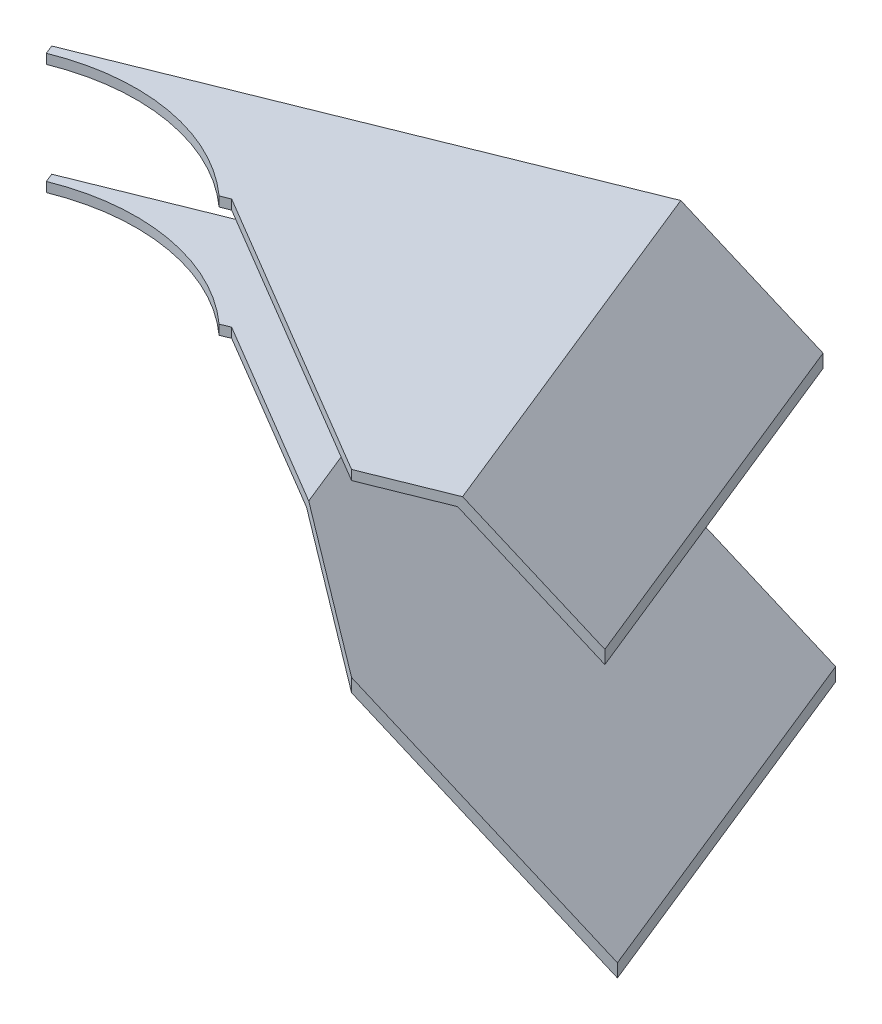
ISO-10303-21;
HEADER;
FILE_DESCRIPTION(('STEP AP214'),'2;1');
FILE_NAME('part.step','',(''),(''),'','','');
FILE_SCHEMA(('AUTOMOTIVE_DESIGN { 1 0 10303 214 1 1 1 1 }'));
ENDSEC;
DATA;
#1=APPLICATION_CONTEXT('core data for automotive mechanical design processes');
#2=APPLICATION_PROTOCOL_DEFINITION('international standard','automotive_design',2000,#1);
#3=PRODUCT_CONTEXT('',#1,'mechanical');
#4=PRODUCT('Part','Part','',(#3));
#5=PRODUCT_RELATED_PRODUCT_CATEGORY('part','',(#4));
#6=PRODUCT_DEFINITION_FORMATION('','',#4);
#7=PRODUCT_DEFINITION_CONTEXT('part definition',#1,'design');
#8=PRODUCT_DEFINITION('design','',#6,#7);
#9=PRODUCT_DEFINITION_SHAPE('','',#8);
#10=(LENGTH_UNIT() NAMED_UNIT(*) SI_UNIT(.MILLI.,.METRE.));
#11=(NAMED_UNIT(*) PLANE_ANGLE_UNIT() SI_UNIT($,.RADIAN.));
#12=(NAMED_UNIT(*) SI_UNIT($,.STERADIAN.) SOLID_ANGLE_UNIT());
#13=UNCERTAINTY_MEASURE_WITH_UNIT(LENGTH_MEASURE(1.E-05),#10,'distance_accuracy_value','');
#14=(GEOMETRIC_REPRESENTATION_CONTEXT(3) GLOBAL_UNCERTAINTY_ASSIGNED_CONTEXT((#13)) GLOBAL_UNIT_ASSIGNED_CONTEXT((#10,
#11,#12)) REPRESENTATION_CONTEXT('',''));
#15=CARTESIAN_POINT('',(0.,0.,0.));
#16=DIRECTION('',(0.,0.,1.));
#17=DIRECTION('',(1.,0.,0.));
#18=AXIS2_PLACEMENT_3D('',#15,#16,#17);
#19=CARTESIAN_POINT('',(7553.19615856294,-13533.9221083861,-2908.80634391672));
#20=DIRECTION('',(5.24130177931055E-11,1.,8.90819272248016E-11));
#21=DIRECTION('',(0.,-8.90819272248016E-11,1.));
#22=AXIS2_PLACEMENT_3D('',#19,#20,#21);
#23=PLANE('',#22);
#24=DIRECTION('',(-0.860396018496133,9.04944208217523E-11,-0.509626030885396));
#25=VECTOR('',#24,1.);
#26=CARTESIAN_POINT('',(7504.54742702291,-13533.9221083908,-2826.6732259337));
#27=LINE('',#26,#25);
#28=CARTESIAN_POINT('',(7574.42514077867,-13533.9221083972,-2785.28356217056));
#29=VERTEX_POINT('',#28);
#30=CARTESIAN_POINT('',(7483.02495207653,-13533.9221083886,-2839.42132476954));
#31=VERTEX_POINT('',#30);
#32=EDGE_CURVE('E150',#29,#31,#27,.T.);
#33=ORIENTED_EDGE('',*,*,#32,.F.);
#34=DIRECTION('',(-0.927453921512782,1.52995893542088E-11,0.373937459303775));
#35=VECTOR('',#34,1.);
#36=CARTESIAN_POINT('',(7599.00349732765,-13533.9221083986,-2795.19323853141));
#37=LINE('',#36,#35);
#38=CARTESIAN_POINT('',(7599.00349732765,-13533.9221083986,-2795.19323853141));
#39=VERTEX_POINT('',#38);
#40=EDGE_CURVE('E154',#39,#29,#37,.T.);
#41=ORIENTED_EDGE('',*,*,#40,.F.);
#42=DIRECTION('',(0.373937459303775,-1.02218573448556E-10,0.927453921512782));
#43=VECTOR('',#42,1.);
#44=CARTESIAN_POINT('',(7553.19615856294,-13533.9221083861,-2908.80634391672));
#45=LINE('',#44,#43);
#46=CARTESIAN_POINT('',(7553.19615856294,-13533.9221083861,-2908.80634391672));
#47=VERTEX_POINT('',#46);
#48=EDGE_CURVE('E52',#47,#39,#45,.T.);
#49=ORIENTED_EDGE('',*,*,#48,.F.);
#50=DIRECTION('',(-0.927453921512782,1.52995893542088E-11,0.373937459303775));
#51=VECTOR('',#50,1.);
#52=CARTESIAN_POINT('',(7553.19615856294,-13533.9221083861,-2908.80634391672));
#53=LINE('',#52,#51);
#54=CARTESIAN_POINT('',(7413.88728930708,-13533.9221083864,-2852.63880457089));
#55=VERTEX_POINT('',#54);
#56=EDGE_CURVE('E168',#47,#55,#53,.T.);
#57=ORIENTED_EDGE('',*,*,#56,.T.);
#58=DIRECTION('',(0.373937459303983,-1.02436577738745E-10,0.927453921512698));
#59=VECTOR('',#58,1.);
#60=CARTESIAN_POINT('',(7415.00910168499,-13533.9221083868,-2849.85644280635));
#61=LINE('',#60,#59);
#62=CARTESIAN_POINT('',(7415.00910168499,-13533.9221083868,-2849.85644280635));
#63=VERTEX_POINT('',#62);
#64=EDGE_CURVE('E137',#55,#63,#61,.T.);
#65=ORIENTED_EDGE('',*,*,#64,.T.);
#66=CARTESIAN_POINT('',(7438.38019289148,-13533.9221083931,-2791.8905727118));
#67=DIRECTION('',(-5.27512182205092E-11,-1.,-8.90174511533599E-11));
#68=DIRECTION('',(0.,8.90174511533599E-11,-1.));
#69=AXIS2_PLACEMENT_3D('',#66,#67,#68);
#70=CIRCLE('',#69,62.4999999999943);
#71=CARTESIAN_POINT('',(7480.242590312,-13533.9221083912,-2838.29951239163));
#72=VERTEX_POINT('',#71);
#73=EDGE_CURVE('E143',#63,#72,#70,.T.);
#74=ORIENTED_EDGE('',*,*,#73,.T.);
#75=DIRECTION('',(0.927453921512519,-1.5395092608196E-11,-0.373937459304427));
#76=VECTOR('',#75,1.);
#77=CARTESIAN_POINT('',(7483.02495207653,-13533.9221083913,-2839.42132476954));
#78=LINE('',#77,#76);
#79=EDGE_CURVE('E119',#72,#31,#78,.T.);
#80=ORIENTED_EDGE('',*,*,#79,.T.);
#81=EDGE_LOOP('',(#33,#41,#49,#57,#65,#74,#80));
#82=FACE_BOUND('',#81,.T.);
#83=ADVANCED_FACE('F45',(#82),#23,.T.);
#84=CARTESIAN_POINT('',(7553.19615856294,-13533.9221083861,-2908.80634391672));
#85=DIRECTION('',(0.632522053543597,0.731353701608722,-0.255024733945967));
#86=DIRECTION('',(-0.756363206616364,0.654151893429203,0.));
#87=AXIS2_PLACEMENT_3D('',#84,#85,#86);
#88=PLANE('',#87);
#89=ORIENTED_EDGE('',*,*,#48,.T.);
#90=DIRECTION('',(-0.678296858543831,0.681998360073703,0.27348054509663));
#91=VECTOR('',#90,1.);
#92=CARTESIAN_POINT('',(7599.00349732765,-13533.9221083986,-2795.19323853141));
#93=LINE('',#92,#91);
#94=CARTESIAN_POINT('',(7630.5126142916,-13565.6031722663,-2807.89730810548));
#95=VERTEX_POINT('',#94);
#96=EDGE_CURVE('E165',#95,#39,#93,.T.);
#97=ORIENTED_EDGE('',*,*,#96,.F.);
#98=DIRECTION('',(0.373937459303775,-1.02218573448556E-10,0.927453921512782));
#99=VECTOR('',#98,1.);
#100=CARTESIAN_POINT('',(7584.70527552688,-13565.6031722537,-2921.51041349079));
#101=LINE('',#100,#99);
#102=CARTESIAN_POINT('',(7584.70527552688,-13565.6031722537,-2921.51041349079));
#103=VERTEX_POINT('',#102);
#104=EDGE_CURVE('E184',#103,#95,#101,.T.);
#105=ORIENTED_EDGE('',*,*,#104,.F.);
#106=DIRECTION('',(-0.678296858543831,0.681998360073703,0.27348054509663));
#107=VECTOR('',#106,1.);
#108=CARTESIAN_POINT('',(7553.19615856294,-13533.9221083861,-2908.80634391672));
#109=LINE('',#108,#107);
#110=EDGE_CURVE('E179',#103,#47,#109,.T.);
#111=ORIENTED_EDGE('',*,*,#110,.T.);
#112=EDGE_LOOP('',(#89,#97,#105,#111));
#113=FACE_BOUND('',#112,.T.);
#114=ADVANCED_FACE('F201',(#113),#88,.T.);
#115=CARTESIAN_POINT('',(7584.70527552688,-13565.6031722537,-2921.51041349079));
#116=DIRECTION('',(0.927453921512782,-1.52798057152088E-11,-0.373937459303775));
#117=DIRECTION('',(-0.373937459303775,0.,-0.927453921512782));
#118=AXIS2_PLACEMENT_3D('',#115,#116,#117);
#119=PLANE('',#118);
#120=ORIENTED_EDGE('',*,*,#104,.T.);
#121=DIRECTION('',(5.23988543789599E-11,1.,8.90997048633968E-11));
#122=VECTOR('',#121,1.);
#123=CARTESIAN_POINT('',(7630.5126142916,-13565.6031722663,-2807.89730810548));
#124=LINE('',#123,#122);
#125=CARTESIAN_POINT('',(7630.51261429138,-13569.7051546496,-2807.89730810584));
#126=VERTEX_POINT('',#125);
#127=EDGE_CURVE('E162',#126,#95,#124,.T.);
#128=ORIENTED_EDGE('',*,*,#127,.F.);
#129=DIRECTION('',(0.373937459303775,-1.02218573448556E-10,0.927453921512782));
#130=VECTOR('',#129,1.);
#131=CARTESIAN_POINT('',(7584.70527552667,-13569.705154637,-2921.51041349116));
#132=LINE('',#131,#130);
#133=CARTESIAN_POINT('',(7584.70527552667,-13569.705154637,-2921.51041349116));
#134=VERTEX_POINT('',#133);
#135=EDGE_CURVE('E186',#134,#126,#132,.T.);
#136=ORIENTED_EDGE('',*,*,#135,.F.);
#137=DIRECTION('',(5.23988543789599E-11,1.,8.90997048633968E-11));
#138=VECTOR('',#137,1.);
#139=CARTESIAN_POINT('',(7584.70527552688,-13565.6031722537,-2921.51041349079));
#140=LINE('',#139,#138);
#141=EDGE_CURVE('E176',#134,#103,#140,.T.);
#142=ORIENTED_EDGE('',*,*,#141,.T.);
#143=EDGE_LOOP('',(#120,#128,#136,#142));
#144=FACE_BOUND('',#143,.T.);
#145=ADVANCED_FACE('F197',(#144),#119,.T.);
#146=CARTESIAN_POINT('',(7552.10015711678,-13536.922108386,-2908.36445026966));
#147=DIRECTION('',(-0.632522053543585,-0.731353701608734,0.255024733945962));
#148=DIRECTION('',(0.756363206616375,-0.65415189342919,0.));
#149=AXIS2_PLACEMENT_3D('',#146,#147,#148);
#150=PLANE('',#149);
#151=ORIENTED_EDGE('',*,*,#135,.T.);
#152=DIRECTION('',(0.67829685854384,-0.68199836007369,-0.273480545096639));
#153=VECTOR('',#152,1.);
#154=CARTESIAN_POINT('',(7597.90749588149,-13536.9221083986,-2794.75134488434));
#155=LINE('',#154,#153);
#156=CARTESIAN_POINT('',(7597.90749588149,-13536.9221083986,-2794.75134488434));
#157=VERTEX_POINT('',#156);
#158=EDGE_CURVE('E159',#157,#126,#155,.T.);
#159=ORIENTED_EDGE('',*,*,#158,.F.);
#160=DIRECTION('',(0.373937459303775,-1.02218573448556E-10,0.927453921512782));
#161=VECTOR('',#160,1.);
#162=CARTESIAN_POINT('',(7552.10015711678,-13536.922108386,-2908.36445026966));
#163=LINE('',#162,#161);
#164=CARTESIAN_POINT('',(7552.10015711678,-13536.922108386,-2908.36445026966));
#165=VERTEX_POINT('',#164);
#166=EDGE_CURVE('E182',#165,#157,#163,.T.);
#167=ORIENTED_EDGE('',*,*,#166,.F.);
#168=DIRECTION('',(0.67829685854384,-0.68199836007369,-0.273480545096639));
#169=VECTOR('',#168,1.);
#170=CARTESIAN_POINT('',(7552.10015711678,-13536.922108386,-2908.36445026966));
#171=LINE('',#170,#169);
#172=EDGE_CURVE('E173',#165,#134,#171,.T.);
#173=ORIENTED_EDGE('',*,*,#172,.T.);
#174=EDGE_LOOP('',(#151,#159,#167,#173));
#175=FACE_BOUND('',#174,.T.);
#176=ADVANCED_FACE('F191',(#175),#150,.T.);
#177=CARTESIAN_POINT('',(7468.77353534096,-13536.9221083847,-2874.76823107594));
#178=DIRECTION('',(-5.24162843361984E-11,-1.,-8.90806101967569E-11));
#179=DIRECTION('',(0.,8.90806101967569E-11,-1.));
#180=AXIS2_PLACEMENT_3D('',#177,#178,#179);
#181=PLANE('',#180);
#182=DIRECTION('',(0.860396018496133,-9.04965601506487E-11,0.509626030885396));
#183=VECTOR('',#182,1.);
#184=CARTESIAN_POINT('',(7456.97597581987,-13536.9221083858,-2854.85054119207));
#185=LINE('',#184,#183);
#186=CARTESIAN_POINT('',(7483.02495207637,-13536.9221083913,-2839.42132476981));
#187=VERTEX_POINT('',#186);
#188=CARTESIAN_POINT('',(7574.4251407783,-13536.9221083982,-2785.28356217074));
#189=VERTEX_POINT('',#188);
#190=EDGE_CURVE('E58',#187,#189,#185,.T.);
#191=ORIENTED_EDGE('',*,*,#190,.F.);
#192=DIRECTION('',(0.927453921512519,-1.5395092608196E-11,-0.373937459304427));
#193=VECTOR('',#192,1.);
#194=CARTESIAN_POINT('',(7483.02495207637,-13536.9221083913,-2839.42132476981));
#195=LINE('',#194,#193);
#196=CARTESIAN_POINT('',(7480.24259031184,-13536.9221083912,-2838.2995123919));
#197=VERTEX_POINT('',#196);
#198=EDGE_CURVE('E117',#197,#187,#195,.T.);
#199=ORIENTED_EDGE('',*,*,#198,.F.);
#200=CARTESIAN_POINT('',(7438.38019289132,-13536.9221083931,-2791.89057271207));
#201=DIRECTION('',(-5.27512182205092E-11,-1.,-8.90174511533599E-11));
#202=DIRECTION('',(0.,8.90174511533599E-11,-1.));
#203=AXIS2_PLACEMENT_3D('',#200,#201,#202);
#204=CIRCLE('',#203,62.4999999999943);
#205=CARTESIAN_POINT('',(7415.00910168484,-13536.9221083868,-2849.85644280661));
#206=VERTEX_POINT('',#205);
#207=EDGE_CURVE('E131',#206,#197,#204,.T.);
#208=ORIENTED_EDGE('',*,*,#207,.F.);
#209=DIRECTION('',(0.373937459303983,-1.02436577738745E-10,0.927453921512698));
#210=VECTOR('',#209,1.);
#211=CARTESIAN_POINT('',(7415.00910168484,-13536.9221083868,-2849.85644280661));
#212=LINE('',#211,#210);
#213=CARTESIAN_POINT('',(7413.88728930692,-13536.9221083864,-2852.63880457115));
#214=VERTEX_POINT('',#213);
#215=EDGE_CURVE('E125',#214,#206,#212,.T.);
#216=ORIENTED_EDGE('',*,*,#215,.F.);
#217=DIRECTION('',(0.927453921512783,-1.53031114085313E-11,-0.373937459303772));
#218=VECTOR('',#217,1.);
#219=CARTESIAN_POINT('',(7468.77353534096,-13536.9221083847,-2874.76823107594));
#220=LINE('',#219,#218);
#221=EDGE_CURVE('E170',#214,#165,#220,.T.);
#222=ORIENTED_EDGE('',*,*,#221,.T.);
#223=ORIENTED_EDGE('',*,*,#166,.T.);
#224=DIRECTION('',(0.927453921512783,-1.53031114085313E-11,-0.373937459303772));
#225=VECTOR('',#224,1.);
#226=CARTESIAN_POINT('',(7514.58087410568,-13536.9221083972,-2761.15512569062));
#227=LINE('',#226,#225);
#228=EDGE_CURVE('E157',#189,#157,#227,.T.);
#229=ORIENTED_EDGE('',*,*,#228,.F.);
#230=EDGE_LOOP('',(#191,#199,#208,#216,#222,#223,#229));
#231=FACE_BOUND('',#230,.T.);
#232=ADVANCED_FACE('F129',(#231),#181,.T.);
#233=CARTESIAN_POINT('',(47.3551152509414,-1.29498669263168E-08,117.451959546787));
#234=DIRECTION('',(0.373937459303775,-1.02244305073433E-10,0.927453921512782));
#235=DIRECTION('',(0.927453921512782,0.,-0.373937459303775));
#236=AXIS2_PLACEMENT_3D('',#233,#234,#235);
#237=PLANE('',#236);
#238=ORIENTED_EDGE('',*,*,#56,.F.);
#239=ORIENTED_EDGE('',*,*,#110,.F.);
#240=ORIENTED_EDGE('',*,*,#141,.F.);
#241=ORIENTED_EDGE('',*,*,#172,.F.);
#242=ORIENTED_EDGE('',*,*,#221,.F.);
#243=DIRECTION('',(5.27512182205092E-11,1.,8.90174511533599E-11));
#244=VECTOR('',#243,1.);
#245=CARTESIAN_POINT('',(7413.88728930692,-13536.9221083864,-2852.63880457115));
#246=LINE('',#245,#244);
#247=EDGE_CURVE('E124',#214,#55,#246,.T.);
#248=ORIENTED_EDGE('',*,*,#247,.T.);
#249=EDGE_LOOP('',(#238,#239,#240,#241,#242,#248));
#250=FACE_BOUND('',#249,.T.);
#251=ADVANCED_FACE('F212',(#250),#237,.F.);
#252=CARTESIAN_POINT('',(93.1624540156537,-2.54716421737649E-08,231.065064932103));
#253=DIRECTION('',(0.373937459303775,-1.02244305073433E-10,0.927453921512782));
#254=DIRECTION('',(0.927453921512782,0.,-0.373937459303775));
#255=AXIS2_PLACEMENT_3D('',#252,#253,#254);
#256=PLANE('',#255);
#257=DIRECTION('',(5.24347373025043E-11,1.,8.91009145688702E-11));
#258=VECTOR('',#257,1.);
#259=CARTESIAN_POINT('',(7574.42514148832,-1.48990264656463E-07,-2785.28356096468));
#260=LINE('',#259,#258);
#261=EDGE_CURVE('E12',#189,#29,#260,.T.);
#262=ORIENTED_EDGE('',*,*,#261,.F.);
#263=ORIENTED_EDGE('',*,*,#228,.T.);
#264=ORIENTED_EDGE('',*,*,#158,.T.);
#265=ORIENTED_EDGE('',*,*,#127,.T.);
#266=ORIENTED_EDGE('',*,*,#96,.T.);
#267=ORIENTED_EDGE('',*,*,#40,.T.);
#268=EDGE_LOOP('',(#262,#263,#264,#265,#266,#267));
#269=FACE_BOUND('',#268,.T.);
#270=ADVANCED_FACE('F194',(#269),#256,.T.);
#271=CARTESIAN_POINT('',(7686.74443183162,-13620.4408663085,-2718.75508777466));
#272=DIRECTION('',(0.509626030885396,4.99399650874263E-11,-0.860396018496132));
#273=DIRECTION('',(-0.860396018496133,0.,-0.509626030885396));
#274=AXIS2_PLACEMENT_3D('',#271,#272,#273);
#275=PLANE('',#274);
#276=DIRECTION('',(-5.23855421228145E-11,-1.,-8.90717754938105E-11));
#277=VECTOR('',#276,1.);
#278=CARTESIAN_POINT('',(7483.02495207653,-13533.9221083886,-2839.42132476954));
#279=LINE('',#278,#277);
#280=EDGE_CURVE('E152',#31,#187,#279,.T.);
#281=ORIENTED_EDGE('',*,*,#280,.T.);
#282=ORIENTED_EDGE('',*,*,#190,.T.);
#283=ORIENTED_EDGE('',*,*,#261,.T.);
#284=ORIENTED_EDGE('',*,*,#32,.T.);
#285=EDGE_LOOP('',(#281,#282,#283,#284));
#286=FACE_BOUND('',#285,.T.);
#287=ADVANCED_FACE('F203',(#286),#275,.F.);
#288=CARTESIAN_POINT('',(7438.38019289132,-13536.9221083931,-2791.89057271207));
#289=DIRECTION('',(5.27512182205092E-11,1.,8.90174511533599E-11));
#290=DIRECTION('',(0.,-8.90174511533599E-11,1.));
#291=AXIS2_PLACEMENT_3D('',#288,#289,#290);
#292=CYLINDRICAL_SURFACE('',#291,62.4999999999943);
#293=ORIENTED_EDGE('',*,*,#73,.F.);
#294=DIRECTION('',(5.27512182205092E-11,1.,8.90174511533599E-11));
#295=VECTOR('',#294,1.);
#296=CARTESIAN_POINT('',(7415.00910168484,-13536.9221083868,-2849.85644280661));
#297=LINE('',#296,#295);
#298=EDGE_CURVE('E136',#206,#63,#297,.T.);
#299=ORIENTED_EDGE('',*,*,#298,.F.);
#300=ORIENTED_EDGE('',*,*,#207,.T.);
#301=DIRECTION('',(5.27512182205092E-11,1.,8.90174511533599E-11));
#302=VECTOR('',#301,1.);
#303=CARTESIAN_POINT('',(7480.24259031184,-13536.9221083912,-2838.2995123919));
#304=LINE('',#303,#302);
#305=EDGE_CURVE('E113',#197,#72,#304,.T.);
#306=ORIENTED_EDGE('',*,*,#305,.T.);
#307=EDGE_LOOP('',(#293,#299,#300,#306));
#308=FACE_BOUND('',#307,.T.);
#309=ADVANCED_FACE('F135',(#308),#292,.F.);
#310=CARTESIAN_POINT('',(7415.00910168484,-13536.9221083868,-2849.85644280661));
#311=DIRECTION('',(-0.927453921512698,1.56373646851795E-11,0.373937459303983));
#312=DIRECTION('',(0.373937459303983,0.,0.927453921512698));
#313=AXIS2_PLACEMENT_3D('',#310,#311,#312);
#314=PLANE('',#313);
#315=ORIENTED_EDGE('',*,*,#64,.F.);
#316=ORIENTED_EDGE('',*,*,#247,.F.);
#317=ORIENTED_EDGE('',*,*,#215,.T.);
#318=ORIENTED_EDGE('',*,*,#298,.T.);
#319=EDGE_LOOP('',(#315,#316,#317,#318));
#320=FACE_BOUND('',#319,.T.);
#321=ADVANCED_FACE('F210',(#320),#314,.T.);
#322=CARTESIAN_POINT('',(7483.02495207637,-13536.9221083913,-2839.42132476981));
#323=DIRECTION('',(0.373937459304427,-1.02285240671823E-10,0.927453921512519));
#324=DIRECTION('',(0.927453921512519,0.,-0.373937459304427));
#325=AXIS2_PLACEMENT_3D('',#322,#323,#324);
#326=PLANE('',#325);
#327=ORIENTED_EDGE('',*,*,#79,.F.);
#328=ORIENTED_EDGE('',*,*,#305,.F.);
#329=ORIENTED_EDGE('',*,*,#198,.T.);
#330=ORIENTED_EDGE('',*,*,#280,.F.);
#331=EDGE_LOOP('',(#327,#328,#329,#330));
#332=FACE_BOUND('',#331,.T.);
#333=ADVANCED_FACE('F115',(#332),#326,.T.);
#334=CLOSED_SHELL('',(#83,#114,#145,#176,#232,#251,#270,#287,#309,#321,#333));
#335=MANIFOLD_SOLID_BREP('B2',#334);
#336=CARTESIAN_POINT('',(7507.23004430456,-13568.4128979396,-2890.27339950016));
#337=DIRECTION('',(5.24078282945287E-11,1.,8.90840195636962E-11));
#338=DIRECTION('',(0.,-8.90840195636962E-11,1.));
#339=AXIS2_PLACEMENT_3D('',#336,#337,#338);
#340=PLANE('',#339);
#341=DIRECTION('',(-0.860396018496133,9.04910221082049E-11,-0.509626030885396));
#342=VECTOR('',#341,1.);
#343=CARTESIAN_POINT('',(7478.64590112801,-13568.4128979424,-2842.01510520051));
#344=LINE('',#343,#342);
#345=CARTESIAN_POINT('',(7541.75960404408,-13568.4128979396,-2804.63187094541));
#346=VERTEX_POINT('',#345);
#347=CARTESIAN_POINT('',(7483.02495207472,-13568.4128979429,-2839.42132477261));
#348=VERTEX_POINT('',#347);
#349=EDGE_CURVE('E423',#346,#348,#344,.T.);
#350=ORIENTED_EDGE('',*,*,#349,.F.);
#351=DIRECTION('',(0.373937459303775,-1.02218573448556E-10,0.927453921512782));
#352=VECTOR('',#351,1.);
#353=CARTESIAN_POINT('',(7507.23004430456,-13568.4128979396,-2890.27339950016));
#354=LINE('',#353,#352);
#355=CARTESIAN_POINT('',(7507.23004430456,-13568.4128979396,-2890.27339950016));
#356=VERTEX_POINT('',#355);
#357=EDGE_CURVE('E315',#356,#346,#354,.T.);
#358=ORIENTED_EDGE('',*,*,#357,.F.);
#359=DIRECTION('',(-0.927453921512781,1.52939939295125E-11,0.373937459303778));
#360=VECTOR('',#359,1.);
#361=CARTESIAN_POINT('',(7507.23004430456,-13568.4128979396,-2890.27339950016));
#362=LINE('',#361,#360);
#363=CARTESIAN_POINT('',(7413.88728930526,-13568.4128979406,-2852.63880457396));
#364=VERTEX_POINT('',#363);
#365=EDGE_CURVE('E389',#356,#364,#362,.T.);
#366=ORIENTED_EDGE('',*,*,#365,.T.);
#367=DIRECTION('',(0.373937459303983,-1.02436577738745E-10,0.927453921512698));
#368=VECTOR('',#367,1.);
#369=CARTESIAN_POINT('',(7413.88728930526,-13568.4128979406,-2852.63880457396));
#370=LINE('',#369,#368);
#371=CARTESIAN_POINT('',(7415.00910168317,-13568.4128979409,-2849.85644280942));
#372=VERTEX_POINT('',#371);
#373=EDGE_CURVE('E396',#364,#372,#370,.T.);
#374=ORIENTED_EDGE('',*,*,#373,.T.);
#375=CARTESIAN_POINT('',(7438.38019288966,-13568.4128979473,-2791.89057271487));
#376=DIRECTION('',(-5.27270524318287E-11,-1.,-8.90273093712242E-11));
#377=DIRECTION('',(0.,8.90273093712242E-11,-1.));
#378=AXIS2_PLACEMENT_3D('',#375,#376,#377);
#379=CIRCLE('',#378,62.4999999999997);
#380=CARTESIAN_POINT('',(7480.24259031018,-13568.4128979454,-2838.2995123947));
#381=VERTEX_POINT('',#380);
#382=EDGE_CURVE('E409',#372,#381,#379,.T.);
#383=ORIENTED_EDGE('',*,*,#382,.T.);
#384=DIRECTION('',(0.927453921512801,-1.53950926081368E-11,-0.373937459303729));
#385=VECTOR('',#384,1.);
#386=CARTESIAN_POINT('',(7483.02495207472,-13568.4128979455,-2839.42132477261));
#387=LINE('',#386,#385);
#388=EDGE_CURVE('E405',#381,#348,#387,.T.);
#389=ORIENTED_EDGE('',*,*,#388,.T.);
#390=EDGE_LOOP('',(#350,#358,#366,#374,#383,#389));
#391=FACE_BOUND('',#390,.T.);
#392=ADVANCED_FACE('F308',(#391),#340,.T.);
#393=CARTESIAN_POINT('',(7507.23004430456,-13568.4128979396,-2890.27339950016));
#394=DIRECTION('',(0.632522053543588,0.731353701608731,-0.255024733945964));
#395=DIRECTION('',(-0.756363206616372,0.654151893429194,0.));
#396=AXIS2_PLACEMENT_3D('',#393,#394,#395);
#397=PLANE('',#396);
#398=DIRECTION('',(-0.748643325339337,0.492849067078526,-0.443433161259605));
#399=VECTOR('',#398,1.);
#400=CARTESIAN_POINT('',(7493.9762323736,-13536.9560087208,-2832.93471001217));
#401=LINE('',#400,#399);
#402=CARTESIAN_POINT('',(7574.42514077573,-13589.9173697741,-2785.28356217555));
#403=VERTEX_POINT('',#402);
#404=EDGE_CURVE('E421',#403,#346,#401,.T.);
#405=ORIENTED_EDGE('',*,*,#404,.F.);
#406=DIRECTION('',(-0.678296858543839,0.681998360073694,0.273480545096634));
#407=VECTOR('',#406,1.);
#408=CARTESIAN_POINT('',(7553.03738306927,-13568.4128979522,-2776.66029411484));
#409=LINE('',#408,#407);
#410=CARTESIAN_POINT('',(7633.29497605176,-13649.1084608286,-2809.01912049083));
#411=VERTEX_POINT('',#410);
#412=EDGE_CURVE('E435',#411,#403,#409,.T.);
#413=ORIENTED_EDGE('',*,*,#412,.F.);
#414=DIRECTION('',(0.373937459303775,-1.02218573448556E-10,0.927453921512782));
#415=VECTOR('',#414,1.);
#416=CARTESIAN_POINT('',(7587.48763728704,-13649.1084608161,-2922.63222587614));
#417=LINE('',#416,#415);
#418=CARTESIAN_POINT('',(7587.48763728704,-13649.1084608161,-2922.63222587614));
#419=VERTEX_POINT('',#418);
#420=EDGE_CURVE('E448',#419,#411,#417,.T.);
#421=ORIENTED_EDGE('',*,*,#420,.F.);
#422=DIRECTION('',(-0.678296858543839,0.681998360073694,0.273480545096634));
#423=VECTOR('',#422,1.);
#424=CARTESIAN_POINT('',(7507.23004430456,-13568.4128979396,-2890.27339950016));
#425=LINE('',#424,#423);
#426=EDGE_CURVE('E443',#419,#356,#425,.T.);
#427=ORIENTED_EDGE('',*,*,#426,.T.);
#428=ORIENTED_EDGE('',*,*,#357,.T.);
#429=EDGE_LOOP('',(#405,#413,#421,#427,#428));
#430=FACE_BOUND('',#429,.T.);
#431=ADVANCED_FACE('F462',(#430),#397,.T.);
#432=CARTESIAN_POINT('',(7587.48763728683,-13653.2104431994,-2922.63222587651));
#433=DIRECTION('',(0.927453921512782,-1.52798057152154E-11,-0.373937459303775));
#434=DIRECTION('',(-0.373937459303775,0.,-0.927453921512782));
#435=AXIS2_PLACEMENT_3D('',#432,#433,#434);
#436=PLANE('',#435);
#437=ORIENTED_EDGE('',*,*,#420,.T.);
#438=DIRECTION('',(5.23988543789826E-11,1.,8.90997048634353E-11));
#439=VECTOR('',#438,1.);
#440=CARTESIAN_POINT('',(7633.29497605154,-13653.2104432119,-2809.01912049119));
#441=LINE('',#440,#439);
#442=CARTESIAN_POINT('',(7633.29497605154,-13653.2104432119,-2809.01912049119));
#443=VERTEX_POINT('',#442);
#444=EDGE_CURVE('E432',#443,#411,#441,.T.);
#445=ORIENTED_EDGE('',*,*,#444,.F.);
#446=DIRECTION('',(0.373937459303775,-1.02218573448556E-10,0.927453921512782));
#447=VECTOR('',#446,1.);
#448=CARTESIAN_POINT('',(7587.48763728683,-13653.2104431994,-2922.63222587651));
#449=LINE('',#448,#447);
#450=CARTESIAN_POINT('',(7587.48763728683,-13653.2104431994,-2922.63222587651));
#451=VERTEX_POINT('',#450);
#452=EDGE_CURVE('E450',#451,#443,#449,.T.);
#453=ORIENTED_EDGE('',*,*,#452,.F.);
#454=DIRECTION('',(5.23988543789826E-11,1.,8.90997048634353E-11));
#455=VECTOR('',#454,1.);
#456=CARTESIAN_POINT('',(7587.48763728683,-13653.2104431994,-2922.63222587651));
#457=LINE('',#456,#455);
#458=EDGE_CURVE('E440',#451,#419,#457,.T.);
#459=ORIENTED_EDGE('',*,*,#458,.T.);
#460=EDGE_LOOP('',(#437,#445,#453,#459));
#461=FACE_BOUND('',#460,.T.);
#462=ADVANCED_FACE('F483',(#461),#436,.T.);
#463=CARTESIAN_POINT('',(7506.1340428584,-13571.4128979396,-2889.83150585309));
#464=DIRECTION('',(-0.632522053543588,-0.731353701608731,0.255024733945963));
#465=DIRECTION('',(0.756363206616372,-0.654151893429193,0.));
#466=AXIS2_PLACEMENT_3D('',#463,#464,#465);
#467=PLANE('',#466);
#468=DIRECTION('',(0.748643325339337,-0.492849067078525,0.443433161259605));
#469=VECTOR('',#468,1.);
#470=CARTESIAN_POINT('',(7493.10206038358,-13540.4825036388,-2833.45249576685));
#471=LINE('',#470,#469);
#472=CARTESIAN_POINT('',(7540.08568029923,-13571.4128979396,-2805.62336218422));
#473=VERTEX_POINT('',#472);
#474=CARTESIAN_POINT('',(7574.42514077552,-13594.0193521574,-2785.28356217592));
#475=VERTEX_POINT('',#474);
#476=EDGE_CURVE('E321',#473,#475,#471,.T.);
#477=ORIENTED_EDGE('',*,*,#476,.F.);
#478=DIRECTION('',(0.373937459303775,-1.02218573448556E-10,0.927453921512782));
#479=VECTOR('',#478,1.);
#480=CARTESIAN_POINT('',(7506.1340428584,-13571.4128979396,-2889.83150585309));
#481=LINE('',#480,#479);
#482=CARTESIAN_POINT('',(7506.1340428584,-13571.4128979396,-2889.83150585309));
#483=VERTEX_POINT('',#482);
#484=EDGE_CURVE('E446',#483,#473,#481,.T.);
#485=ORIENTED_EDGE('',*,*,#484,.F.);
#486=DIRECTION('',(0.678296858543839,-0.681998360073693,-0.273480545096634));
#487=VECTOR('',#486,1.);
#488=CARTESIAN_POINT('',(7506.1340428584,-13571.4128979396,-2889.83150585309));
#489=LINE('',#488,#487);
#490=EDGE_CURVE('E385',#483,#451,#489,.T.);
#491=ORIENTED_EDGE('',*,*,#490,.T.);
#492=ORIENTED_EDGE('',*,*,#452,.T.);
#493=DIRECTION('',(0.678296858543839,-0.681998360073693,-0.273480545096634));
#494=VECTOR('',#493,1.);
#495=CARTESIAN_POINT('',(7551.94138162311,-13571.4128979522,-2776.21840046778));
#496=LINE('',#495,#494);
#497=EDGE_CURVE('E430',#475,#443,#496,.T.);
#498=ORIENTED_EDGE('',*,*,#497,.F.);
#499=EDGE_LOOP('',(#477,#485,#491,#492,#498));
#500=FACE_BOUND('',#499,.T.);
#501=ADVANCED_FACE('F453',(#500),#467,.T.);
#502=CARTESIAN_POINT('',(7468.77353533916,-13571.412897939,-2874.76823107901));
#503=DIRECTION('',(-5.24149615569104E-11,-1.,-8.90811435243052E-11));
#504=DIRECTION('',(0.,8.90811435243052E-11,-1.));
#505=AXIS2_PLACEMENT_3D('',#502,#503,#504);
#506=PLANE('',#505);
#507=DIRECTION('',(0.860396018496133,-9.04956938342176E-11,0.509626030885396));
#508=VECTOR('',#507,1.);
#509=CARTESIAN_POINT('',(7456.97597581806,-13571.4128979402,-2854.85054119514));
#510=LINE('',#509,#508);
#511=CARTESIAN_POINT('',(7483.02495207456,-13571.4128979455,-2839.42132477288));
#512=VERTEX_POINT('',#511);
#513=EDGE_CURVE('E428',#512,#473,#510,.T.);
#514=ORIENTED_EDGE('',*,*,#513,.F.);
#515=DIRECTION('',(0.927453921512801,-1.53950926081368E-11,-0.373937459303729));
#516=VECTOR('',#515,1.);
#517=CARTESIAN_POINT('',(7483.02495207456,-13571.4128979455,-2839.42132477288));
#518=LINE('',#517,#516);
#519=CARTESIAN_POINT('',(7480.24259031002,-13571.4128979454,-2838.29951239497));
#520=VERTEX_POINT('',#519);
#521=EDGE_CURVE('E398',#520,#512,#518,.T.);
#522=ORIENTED_EDGE('',*,*,#521,.F.);
#523=CARTESIAN_POINT('',(7438.3801928895,-13571.4128979473,-2791.89057271514));
#524=DIRECTION('',(-5.27270524318287E-11,-1.,-8.90273093712242E-11));
#525=DIRECTION('',(0.,8.90273093712242E-11,-1.));
#526=AXIS2_PLACEMENT_3D('',#523,#524,#525);
#527=CIRCLE('',#526,62.4999999999997);
#528=CARTESIAN_POINT('',(7415.00910168302,-13571.4128979409,-2849.85644280968));
#529=VERTEX_POINT('',#528);
#530=EDGE_CURVE('E404',#529,#520,#527,.T.);
#531=ORIENTED_EDGE('',*,*,#530,.F.);
#532=DIRECTION('',(0.373937459303983,-1.02436577738745E-10,0.927453921512698));
#533=VECTOR('',#532,1.);
#534=CARTESIAN_POINT('',(7413.8872893051,-13571.4128979406,-2852.63880457422));
#535=LINE('',#534,#533);
#536=CARTESIAN_POINT('',(7413.8872893051,-13571.4128979406,-2852.63880457422));
#537=VERTEX_POINT('',#536);
#538=EDGE_CURVE('E394',#537,#529,#535,.T.);
#539=ORIENTED_EDGE('',*,*,#538,.F.);
#540=DIRECTION('',(0.927453921512781,-1.53016851605444E-11,-0.373937459303777));
#541=VECTOR('',#540,1.);
#542=CARTESIAN_POINT('',(7468.77353533916,-13571.412897939,-2874.76823107901));
#543=LINE('',#542,#541);
#544=EDGE_CURVE('E378',#537,#483,#543,.T.);
#545=ORIENTED_EDGE('',*,*,#544,.T.);
#546=ORIENTED_EDGE('',*,*,#484,.T.);
#547=EDGE_LOOP('',(#514,#522,#531,#539,#545,#546));
#548=FACE_BOUND('',#547,.T.);
#549=ADVANCED_FACE('F401',(#548),#506,.T.);
#550=CARTESIAN_POINT('',(47.3551152509508,-1.29498669263193E-08,117.451959546809));
#551=DIRECTION('',(0.373937459303778,-1.02244305073433E-10,0.927453921512781));
#552=DIRECTION('',(0.927453921512781,0.,-0.373937459303778));
#553=AXIS2_PLACEMENT_3D('',#550,#551,#552);
#554=PLANE('',#553);
#555=ORIENTED_EDGE('',*,*,#365,.F.);
#556=ORIENTED_EDGE('',*,*,#426,.F.);
#557=ORIENTED_EDGE('',*,*,#458,.F.);
#558=ORIENTED_EDGE('',*,*,#490,.F.);
#559=ORIENTED_EDGE('',*,*,#544,.F.);
#560=DIRECTION('',(5.27270524318287E-11,1.,8.90273093712242E-11));
#561=VECTOR('',#560,1.);
#562=CARTESIAN_POINT('',(7413.8872893051,-13571.4128979406,-2852.63880457422));
#563=LINE('',#562,#561);
#564=EDGE_CURVE('E381',#537,#364,#563,.T.);
#565=ORIENTED_EDGE('',*,*,#564,.T.);
#566=EDGE_LOOP('',(#555,#556,#557,#558,#559,#565));
#567=FACE_BOUND('',#566,.T.);
#568=ADVANCED_FACE('F380',(#567),#554,.F.);
#569=CARTESIAN_POINT('',(93.1624540156632,-2.54716421737674E-08,231.065064932125));
#570=DIRECTION('',(0.373937459303778,-1.02244305073433E-10,0.927453921512781));
#571=DIRECTION('',(0.927453921512781,0.,-0.373937459303778));
#572=AXIS2_PLACEMENT_3D('',#569,#570,#571);
#573=PLANE('',#572);
#574=DIRECTION('',(5.24347373025043E-11,1.,8.91009145688702E-11));
#575=VECTOR('',#574,1.);
#576=CARTESIAN_POINT('',(7574.42514148832,-1.48990264656463E-07,-2785.28356096468));
#577=LINE('',#576,#575);
#578=EDGE_CURVE('E43',#475,#403,#577,.T.);
#579=ORIENTED_EDGE('',*,*,#578,.F.);
#580=ORIENTED_EDGE('',*,*,#497,.T.);
#581=ORIENTED_EDGE('',*,*,#444,.T.);
#582=ORIENTED_EDGE('',*,*,#412,.T.);
#583=EDGE_LOOP('',(#579,#580,#581,#582));
#584=FACE_BOUND('',#583,.T.);
#585=ADVANCED_FACE('F457',(#584),#573,.T.);
#586=CARTESIAN_POINT('',(7686.74443183162,-13620.4408663085,-2718.75508777466));
#587=DIRECTION('',(0.509626030885396,4.99399650874263E-11,-0.860396018496132));
#588=DIRECTION('',(-0.860396018496133,0.,-0.509626030885396));
#589=AXIS2_PLACEMENT_3D('',#586,#587,#588);
#590=PLANE('',#589);
#591=ORIENTED_EDGE('',*,*,#513,.T.);
#592=ORIENTED_EDGE('',*,*,#476,.T.);
#593=ORIENTED_EDGE('',*,*,#578,.T.);
#594=ORIENTED_EDGE('',*,*,#404,.T.);
#595=ORIENTED_EDGE('',*,*,#349,.T.);
#596=DIRECTION('',(-5.23855421228145E-11,-1.,-8.90717754938105E-11));
#597=VECTOR('',#596,1.);
#598=CARTESIAN_POINT('',(7483.02495207472,-13568.4128979429,-2839.42132477261));
#599=LINE('',#598,#597);
#600=EDGE_CURVE('E425',#348,#512,#599,.T.);
#601=ORIENTED_EDGE('',*,*,#600,.T.);
#602=EDGE_LOOP('',(#591,#592,#593,#594,#595,#601));
#603=FACE_BOUND('',#602,.T.);
#604=ADVANCED_FACE('F460',(#603),#590,.F.);
#605=CARTESIAN_POINT('',(7483.02495207456,-13571.4128979455,-2839.42132477288));
#606=DIRECTION('',(0.373937459303729,-1.02285347221008E-10,0.927453921512801));
#607=DIRECTION('',(0.927453921512801,0.,-0.373937459303729));
#608=AXIS2_PLACEMENT_3D('',#605,#606,#607);
#609=PLANE('',#608);
#610=ORIENTED_EDGE('',*,*,#388,.F.);
#611=DIRECTION('',(5.27270524318287E-11,1.,8.90273093712242E-11));
#612=VECTOR('',#611,1.);
#613=CARTESIAN_POINT('',(7480.24259031002,-13571.4128979454,-2838.29951239497));
#614=LINE('',#613,#612);
#615=EDGE_CURVE('E417',#520,#381,#614,.T.);
#616=ORIENTED_EDGE('',*,*,#615,.F.);
#617=ORIENTED_EDGE('',*,*,#521,.T.);
#618=ORIENTED_EDGE('',*,*,#600,.F.);
#619=EDGE_LOOP('',(#610,#616,#617,#618));
#620=FACE_BOUND('',#619,.T.);
#621=ADVANCED_FACE('F470',(#620),#609,.T.);
#622=CARTESIAN_POINT('',(7438.3801928895,-13571.4128979473,-2791.89057271514));
#623=DIRECTION('',(5.27270524318287E-11,1.,8.90273093712242E-11));
#624=DIRECTION('',(0.,-8.90273093712242E-11,1.));
#625=AXIS2_PLACEMENT_3D('',#622,#623,#624);
#626=CYLINDRICAL_SURFACE('',#625,62.4999999999997);
#627=ORIENTED_EDGE('',*,*,#382,.F.);
#628=DIRECTION('',(5.27270524318287E-11,1.,8.90273093712242E-11));
#629=VECTOR('',#628,1.);
#630=CARTESIAN_POINT('',(7415.00910168302,-13571.4128979409,-2849.85644280968));
#631=LINE('',#630,#629);
#632=EDGE_CURVE('E397',#529,#372,#631,.T.);
#633=ORIENTED_EDGE('',*,*,#632,.F.);
#634=ORIENTED_EDGE('',*,*,#530,.T.);
#635=ORIENTED_EDGE('',*,*,#615,.T.);
#636=EDGE_LOOP('',(#627,#633,#634,#635));
#637=FACE_BOUND('',#636,.T.);
#638=ADVANCED_FACE('F467',(#637),#626,.F.);
#639=CARTESIAN_POINT('',(7413.8872893051,-13571.4128979406,-2852.63880457422));
#640=DIRECTION('',(-0.927453921512698,1.56112656727599E-11,0.373937459303983));
#641=DIRECTION('',(0.373937459303983,0.,0.927453921512698));
#642=AXIS2_PLACEMENT_3D('',#639,#640,#641);
#643=PLANE('',#642);
#644=ORIENTED_EDGE('',*,*,#373,.F.);
#645=ORIENTED_EDGE('',*,*,#564,.F.);
#646=ORIENTED_EDGE('',*,*,#538,.T.);
#647=ORIENTED_EDGE('',*,*,#632,.T.);
#648=EDGE_LOOP('',(#644,#645,#646,#647));
#649=FACE_BOUND('',#648,.T.);
#650=ADVANCED_FACE('F393',(#649),#643,.T.);
#651=CLOSED_SHELL('',(#392,#431,#462,#501,#549,#568,#585,#604,#621,#638,#650));
#652=MANIFOLD_SOLID_BREP('B6',#651);
#653=ADVANCED_BREP_SHAPE_REPRESENTATION('',(#18,#335,#652),#14);
#654=SHAPE_DEFINITION_REPRESENTATION(#9,#653);
ENDSEC;
END-ISO-10303-21;
